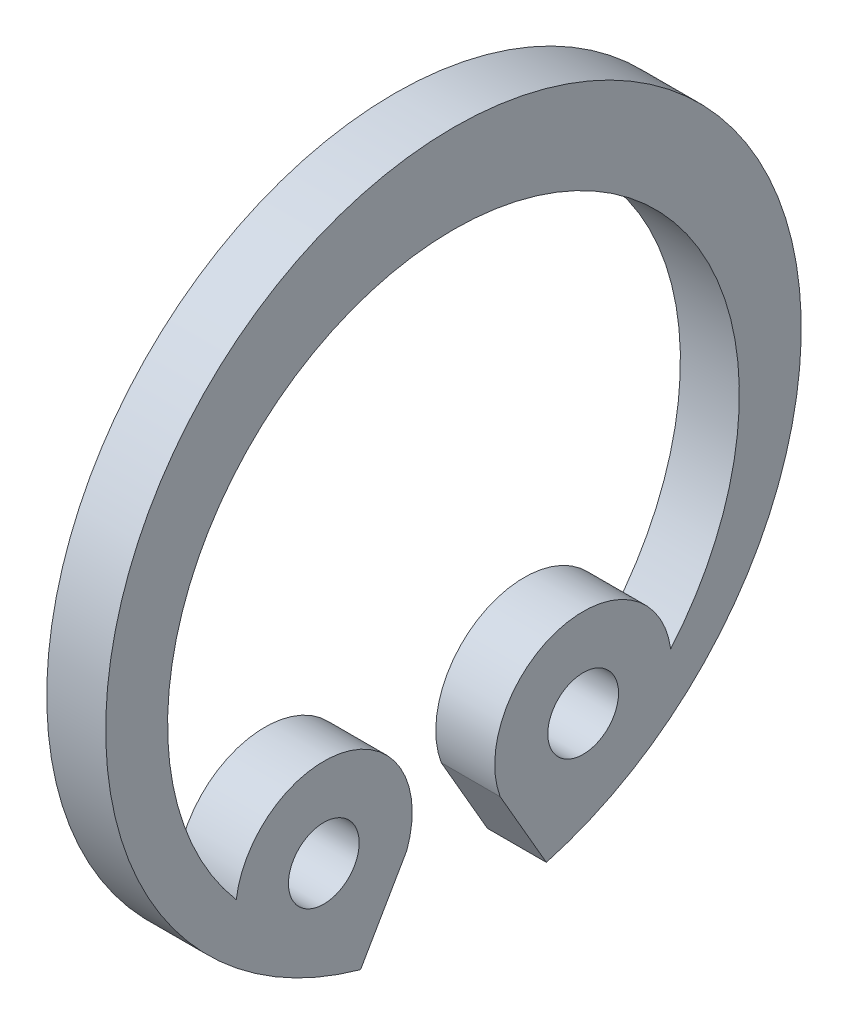
ISO-10303-21;
HEADER;
FILE_DESCRIPTION(('STEP AP214'),'2;1');
FILE_NAME('part.step','',(''),(''),'','','');
FILE_SCHEMA(('AUTOMOTIVE_DESIGN { 1 0 10303 214 1 1 1 1 }'));
ENDSEC;
DATA;
#1=APPLICATION_CONTEXT('core data for automotive mechanical design processes');
#2=APPLICATION_PROTOCOL_DEFINITION('international standard','automotive_design',2000,#1);
#3=PRODUCT_CONTEXT('',#1,'mechanical');
#4=PRODUCT('Part','Part','',(#3));
#5=PRODUCT_RELATED_PRODUCT_CATEGORY('part','',(#4));
#6=PRODUCT_DEFINITION_FORMATION('','',#4);
#7=PRODUCT_DEFINITION_CONTEXT('part definition',#1,'design');
#8=PRODUCT_DEFINITION('design','',#6,#7);
#9=PRODUCT_DEFINITION_SHAPE('','',#8);
#10=(LENGTH_UNIT() NAMED_UNIT(*) SI_UNIT(.MILLI.,.METRE.));
#11=(NAMED_UNIT(*) PLANE_ANGLE_UNIT() SI_UNIT($,.RADIAN.));
#12=(NAMED_UNIT(*) SI_UNIT($,.STERADIAN.) SOLID_ANGLE_UNIT());
#13=UNCERTAINTY_MEASURE_WITH_UNIT(LENGTH_MEASURE(1.E-05),#10,'distance_accuracy_value','');
#14=(GEOMETRIC_REPRESENTATION_CONTEXT(3) GLOBAL_UNCERTAINTY_ASSIGNED_CONTEXT((#13)) GLOBAL_UNIT_ASSIGNED_CONTEXT((#10,
#11,#12)) REPRESENTATION_CONTEXT('',''));
#15=CARTESIAN_POINT('',(0.,0.,0.));
#16=DIRECTION('',(0.,0.,1.));
#17=DIRECTION('',(1.,0.,0.));
#18=AXIS2_PLACEMENT_3D('',#15,#16,#17);
#19=CARTESIAN_POINT('',(0.5,0.,0.));
#20=DIRECTION('',(1.,0.,0.));
#21=DIRECTION('',(0.,0.,-1.));
#22=AXIS2_PLACEMENT_3D('',#19,#20,#21);
#23=PLANE('',#22);
#24=CARTESIAN_POINT('',(0.5,-3.81051177665153,-2.19999999999997));
#25=DIRECTION('',(1.,0.,0.));
#26=DIRECTION('',(0.,0.,-1.));
#27=AXIS2_PLACEMENT_3D('',#24,#25,#26);
#28=CIRCLE('',#27,0.600000000000028);
#29=CARTESIAN_POINT('',(0.5,-3.81051177665153,-2.8));
#30=VERTEX_POINT('',#29);
#31=EDGE_CURVE('E122',#30,#30,#28,.T.);
#32=ORIENTED_EDGE('',*,*,#31,.F.);
#33=EDGE_LOOP('',(#32));
#34=FACE_BOUND('',#33,.T.);
#35=CARTESIAN_POINT('',(0.5,0.,0.));
#36=DIRECTION('',(1.,0.,0.));
#37=DIRECTION('',(0.,0.,-1.));
#38=AXIS2_PLACEMENT_3D('',#35,#36,#37);
#39=CIRCLE('',#38,5.9);
#40=CARTESIAN_POINT('',(0.5,-5.685642181091,-1.5759038640091));
#41=VERTEX_POINT('',#40);
#42=CARTESIAN_POINT('',(0.5,-5.685642181091,1.5759038640091));
#43=VERTEX_POINT('',#42);
#44=EDGE_CURVE('E125',#41,#43,#39,.T.);
#45=ORIENTED_EDGE('',*,*,#44,.T.);
#46=DIRECTION('',(0.,0.866025403784457,-0.499999999999969));
#47=VECTOR('',#46,1.);
#48=CARTESIAN_POINT('',(0.5,-5.685642181091,1.5759038640091));
#49=LINE('',#48,#47);
#50=CARTESIAN_POINT('',(0.5,-4.328108982016,0.792131706089361));
#51=VERTEX_POINT('',#50);
#52=EDGE_CURVE('E87',#43,#51,#49,.T.);
#53=ORIENTED_EDGE('',*,*,#52,.T.);
#54=CARTESIAN_POINT('',(0.5,-3.81051177665152,2.19999999999998));
#55=DIRECTION('',(1.,0.,0.));
#56=DIRECTION('',(0.,0.,-1.));
#57=AXIS2_PLACEMENT_3D('',#54,#55,#56);
#58=CIRCLE('',#57,1.49999999999997);
#59=CARTESIAN_POINT('',(0.5,-3.6026747022655,3.6855314707237));
#60=VERTEX_POINT('',#59);
#61=EDGE_CURVE('E128',#51,#60,#58,.T.);
#62=ORIENTED_EDGE('',*,*,#61,.T.);
#63=CARTESIAN_POINT('',(0.5,-0.449999999999978,0.));
#64=DIRECTION('',(-1.,0.,0.));
#65=DIRECTION('',(0.,0.,1.));
#66=AXIS2_PLACEMENT_3D('',#63,#64,#65);
#67=CIRCLE('',#66,4.84999999999998);
#68=CARTESIAN_POINT('',(0.5,-3.6026747022655,-3.6855314707237));
#69=VERTEX_POINT('',#68);
#70=EDGE_CURVE('E130',#60,#69,#67,.T.);
#71=ORIENTED_EDGE('',*,*,#70,.T.);
#72=CARTESIAN_POINT('',(0.5,-3.81051177665153,-2.19999999999997));
#73=DIRECTION('',(1.,0.,0.));
#74=DIRECTION('',(0.,0.,-1.));
#75=AXIS2_PLACEMENT_3D('',#72,#73,#74);
#76=CIRCLE('',#75,1.49999999999998);
#77=CARTESIAN_POINT('',(0.5,-4.328108982016,-0.79213170608934));
#78=VERTEX_POINT('',#77);
#79=EDGE_CURVE('E51',#69,#78,#76,.T.);
#80=ORIENTED_EDGE('',*,*,#79,.T.);
#81=DIRECTION('',(0.,-0.866025403784451,-0.499999999999979));
#82=VECTOR('',#81,1.);
#83=CARTESIAN_POINT('',(0.5,-4.328108982016,-0.79213170608934));
#84=LINE('',#83,#82);
#85=EDGE_CURVE('E46',#78,#41,#84,.T.);
#86=ORIENTED_EDGE('',*,*,#85,.T.);
#87=EDGE_LOOP('',(#45,#53,#62,#71,#80,#86));
#88=FACE_BOUND('',#87,.T.);
#89=CARTESIAN_POINT('',(0.5,-3.81051177665152,2.19999999999998));
#90=DIRECTION('',(1.,0.,0.));
#91=DIRECTION('',(0.,0.,-1.));
#92=AXIS2_PLACEMENT_3D('',#89,#90,#91);
#93=CIRCLE('',#92,0.599999999999979);
#94=CARTESIAN_POINT('',(0.5,-3.81051177665152,1.6));
#95=VERTEX_POINT('',#94);
#96=EDGE_CURVE('E119',#95,#95,#93,.T.);
#97=ORIENTED_EDGE('',*,*,#96,.F.);
#98=EDGE_LOOP('',(#97));
#99=FACE_BOUND('',#98,.T.);
#100=ADVANCED_FACE('F31',(#34,#88,#99),#23,.T.);
#101=CARTESIAN_POINT('',(0.5,0.,0.));
#102=DIRECTION('',(-1.,0.,0.));
#103=DIRECTION('',(0.,0.,1.));
#104=AXIS2_PLACEMENT_3D('',#101,#102,#103);
#105=CYLINDRICAL_SURFACE('',#104,5.9);
#106=DIRECTION('',(-1.,0.,0.));
#107=VECTOR('',#106,1.);
#108=CARTESIAN_POINT('',(0.5,-5.685642181091,-1.5759038640091));
#109=LINE('',#108,#107);
#110=CARTESIAN_POINT('',(-0.5,-5.685642181091,-1.5759038640091));
#111=VERTEX_POINT('',#110);
#112=EDGE_CURVE('E102',#41,#111,#109,.T.);
#113=ORIENTED_EDGE('',*,*,#112,.T.);
#114=CARTESIAN_POINT('',(-0.5,0.,0.));
#115=DIRECTION('',(1.,0.,0.));
#116=DIRECTION('',(0.,0.,-1.));
#117=AXIS2_PLACEMENT_3D('',#114,#115,#116);
#118=CIRCLE('',#117,5.9);
#119=CARTESIAN_POINT('',(-0.5,-5.685642181091,1.5759038640091));
#120=VERTEX_POINT('',#119);
#121=EDGE_CURVE('E96',#111,#120,#118,.T.);
#122=ORIENTED_EDGE('',*,*,#121,.T.);
#123=DIRECTION('',(-1.,0.,0.));
#124=VECTOR('',#123,1.);
#125=CARTESIAN_POINT('',(0.5,-5.685642181091,1.5759038640091));
#126=LINE('',#125,#124);
#127=EDGE_CURVE('E11',#43,#120,#126,.T.);
#128=ORIENTED_EDGE('',*,*,#127,.F.);
#129=ORIENTED_EDGE('',*,*,#44,.F.);
#130=EDGE_LOOP('',(#113,#122,#128,#129));
#131=FACE_BOUND('',#130,.T.);
#132=ADVANCED_FACE('F33',(#131),#105,.T.);
#133=CARTESIAN_POINT('',(0.5,-5.685642181091,1.5759038640091));
#134=DIRECTION('',(0.,0.499999999999969,0.866025403784457));
#135=DIRECTION('',(0.,-0.866025403784456,0.499999999999969));
#136=AXIS2_PLACEMENT_3D('',#133,#134,#135);
#137=PLANE('',#136);
#138=ORIENTED_EDGE('',*,*,#127,.T.);
#139=DIRECTION('',(0.,0.866025403784457,-0.499999999999969));
#140=VECTOR('',#139,1.);
#141=CARTESIAN_POINT('',(-0.5,-5.685642181091,1.5759038640091));
#142=LINE('',#141,#140);
#143=CARTESIAN_POINT('',(-0.5,-4.328108982016,0.792131706089361));
#144=VERTEX_POINT('',#143);
#145=EDGE_CURVE('E86',#120,#144,#142,.T.);
#146=ORIENTED_EDGE('',*,*,#145,.T.);
#147=DIRECTION('',(-1.,0.,0.));
#148=VECTOR('',#147,1.);
#149=CARTESIAN_POINT('',(0.5,-4.328108982016,0.792131706089361));
#150=LINE('',#149,#148);
#151=EDGE_CURVE('E39',#51,#144,#150,.T.);
#152=ORIENTED_EDGE('',*,*,#151,.F.);
#153=ORIENTED_EDGE('',*,*,#52,.F.);
#154=EDGE_LOOP('',(#138,#146,#152,#153));
#155=FACE_BOUND('',#154,.T.);
#156=ADVANCED_FACE('F84',(#155),#137,.F.);
#157=CARTESIAN_POINT('',(0.5,-3.81051177665152,2.19999999999998));
#158=DIRECTION('',(-1.,0.,0.));
#159=DIRECTION('',(0.,0.,1.));
#160=AXIS2_PLACEMENT_3D('',#157,#158,#159);
#161=CYLINDRICAL_SURFACE('',#160,1.49999999999997);
#162=ORIENTED_EDGE('',*,*,#151,.T.);
#163=CARTESIAN_POINT('',(-0.5,-3.81051177665152,2.19999999999998));
#164=DIRECTION('',(1.,0.,0.));
#165=DIRECTION('',(0.,0.,-1.));
#166=AXIS2_PLACEMENT_3D('',#163,#164,#165);
#167=CIRCLE('',#166,1.49999999999997);
#168=CARTESIAN_POINT('',(-0.5,-3.6026747022655,3.6855314707237));
#169=VERTEX_POINT('',#168);
#170=EDGE_CURVE('E100',#144,#169,#167,.T.);
#171=ORIENTED_EDGE('',*,*,#170,.T.);
#172=DIRECTION('',(-1.,0.,0.));
#173=VECTOR('',#172,1.);
#174=CARTESIAN_POINT('',(0.5,-3.6026747022655,3.6855314707237));
#175=LINE('',#174,#173);
#176=EDGE_CURVE('E139',#60,#169,#175,.T.);
#177=ORIENTED_EDGE('',*,*,#176,.F.);
#178=ORIENTED_EDGE('',*,*,#61,.F.);
#179=EDGE_LOOP('',(#162,#171,#177,#178));
#180=FACE_BOUND('',#179,.T.);
#181=ADVANCED_FACE('F142',(#180),#161,.T.);
#182=CARTESIAN_POINT('',(0.5,-0.449999999999978,0.));
#183=DIRECTION('',(-1.,0.,0.));
#184=DIRECTION('',(0.,0.,1.));
#185=AXIS2_PLACEMENT_3D('',#182,#183,#184);
#186=CYLINDRICAL_SURFACE('',#185,4.84999999999998);
#187=ORIENTED_EDGE('',*,*,#176,.T.);
#188=CARTESIAN_POINT('',(-0.5,-0.449999999999978,0.));
#189=DIRECTION('',(-1.,0.,0.));
#190=DIRECTION('',(0.,0.,1.));
#191=AXIS2_PLACEMENT_3D('',#188,#189,#190);
#192=CIRCLE('',#191,4.84999999999998);
#193=CARTESIAN_POINT('',(-0.5,-3.6026747022655,-3.6855314707237));
#194=VERTEX_POINT('',#193);
#195=EDGE_CURVE('E111',#169,#194,#192,.T.);
#196=ORIENTED_EDGE('',*,*,#195,.T.);
#197=DIRECTION('',(-1.,0.,0.));
#198=VECTOR('',#197,1.);
#199=CARTESIAN_POINT('',(0.5,-3.6026747022655,-3.6855314707237));
#200=LINE('',#199,#198);
#201=EDGE_CURVE('E137',#69,#194,#200,.T.);
#202=ORIENTED_EDGE('',*,*,#201,.F.);
#203=ORIENTED_EDGE('',*,*,#70,.F.);
#204=EDGE_LOOP('',(#187,#196,#202,#203));
#205=FACE_BOUND('',#204,.T.);
#206=ADVANCED_FACE('F148',(#205),#186,.F.);
#207=CARTESIAN_POINT('',(0.5,-3.81051177665153,-2.19999999999997));
#208=DIRECTION('',(-1.,0.,0.));
#209=DIRECTION('',(0.,0.,1.));
#210=AXIS2_PLACEMENT_3D('',#207,#208,#209);
#211=CYLINDRICAL_SURFACE('',#210,1.49999999999998);
#212=ORIENTED_EDGE('',*,*,#201,.T.);
#213=CARTESIAN_POINT('',(-0.5,-3.81051177665153,-2.19999999999997));
#214=DIRECTION('',(1.,0.,0.));
#215=DIRECTION('',(0.,0.,-1.));
#216=AXIS2_PLACEMENT_3D('',#213,#214,#215);
#217=CIRCLE('',#216,1.49999999999998);
#218=CARTESIAN_POINT('',(-0.5,-4.328108982016,-0.79213170608934));
#219=VERTEX_POINT('',#218);
#220=EDGE_CURVE('E114',#194,#219,#217,.T.);
#221=ORIENTED_EDGE('',*,*,#220,.T.);
#222=DIRECTION('',(-1.,0.,0.));
#223=VECTOR('',#222,1.);
#224=CARTESIAN_POINT('',(0.5,-4.328108982016,-0.79213170608934));
#225=LINE('',#224,#223);
#226=EDGE_CURVE('E135',#78,#219,#225,.T.);
#227=ORIENTED_EDGE('',*,*,#226,.F.);
#228=ORIENTED_EDGE('',*,*,#79,.F.);
#229=EDGE_LOOP('',(#212,#221,#227,#228));
#230=FACE_BOUND('',#229,.T.);
#231=ADVANCED_FACE('F151',(#230),#211,.T.);
#232=CARTESIAN_POINT('',(0.5,-4.328108982016,-0.79213170608934));
#233=DIRECTION('',(0.,0.499999999999979,-0.866025403784451));
#234=DIRECTION('',(0.,0.866025403784451,0.499999999999979));
#235=AXIS2_PLACEMENT_3D('',#232,#233,#234);
#236=PLANE('',#235);
#237=ORIENTED_EDGE('',*,*,#226,.T.);
#238=DIRECTION('',(0.,-0.866025403784451,-0.499999999999979));
#239=VECTOR('',#238,1.);
#240=CARTESIAN_POINT('',(-0.5,-4.328108982016,-0.79213170608934));
#241=LINE('',#240,#239);
#242=EDGE_CURVE('E117',#219,#111,#241,.T.);
#243=ORIENTED_EDGE('',*,*,#242,.T.);
#244=ORIENTED_EDGE('',*,*,#112,.F.);
#245=ORIENTED_EDGE('',*,*,#85,.F.);
#246=EDGE_LOOP('',(#237,#243,#244,#245));
#247=FACE_BOUND('',#246,.T.);
#248=ADVANCED_FACE('F153',(#247),#236,.F.);
#249=CARTESIAN_POINT('',(0.5,-3.81051177665153,-2.19999999999997));
#250=DIRECTION('',(-1.,0.,0.));
#251=DIRECTION('',(0.,0.,1.));
#252=AXIS2_PLACEMENT_3D('',#249,#250,#251);
#253=CYLINDRICAL_SURFACE('',#252,0.600000000000028);
#254=ORIENTED_EDGE('',*,*,#31,.T.);
#255=EDGE_LOOP('',(#254));
#256=FACE_BOUND('',#255,.T.);
#257=CARTESIAN_POINT('',(-0.5,-3.81051177665153,-2.19999999999997));
#258=DIRECTION('',(1.,0.,0.));
#259=DIRECTION('',(0.,0.,-1.));
#260=AXIS2_PLACEMENT_3D('',#257,#258,#259);
#261=CIRCLE('',#260,0.600000000000028);
#262=CARTESIAN_POINT('',(-0.5,-3.81051177665153,-2.8));
#263=VERTEX_POINT('',#262);
#264=EDGE_CURVE('E103',#263,#263,#261,.T.);
#265=ORIENTED_EDGE('',*,*,#264,.F.);
#266=EDGE_LOOP('',(#265));
#267=FACE_BOUND('',#266,.T.);
#268=ADVANCED_FACE('F155',(#256,#267),#253,.F.);
#269=CARTESIAN_POINT('',(0.5,-3.81051177665152,2.19999999999998));
#270=DIRECTION('',(-1.,0.,0.));
#271=DIRECTION('',(0.,0.,1.));
#272=AXIS2_PLACEMENT_3D('',#269,#270,#271);
#273=CYLINDRICAL_SURFACE('',#272,0.599999999999979);
#274=ORIENTED_EDGE('',*,*,#96,.T.);
#275=EDGE_LOOP('',(#274));
#276=FACE_BOUND('',#275,.T.);
#277=CARTESIAN_POINT('',(-0.5,-3.81051177665152,2.19999999999998));
#278=DIRECTION('',(1.,0.,0.));
#279=DIRECTION('',(0.,0.,-1.));
#280=AXIS2_PLACEMENT_3D('',#277,#278,#279);
#281=CIRCLE('',#280,0.599999999999979);
#282=CARTESIAN_POINT('',(-0.5,-3.81051177665152,1.6));
#283=VERTEX_POINT('',#282);
#284=EDGE_CURVE('E106',#283,#283,#281,.T.);
#285=ORIENTED_EDGE('',*,*,#284,.F.);
#286=EDGE_LOOP('',(#285));
#287=FACE_BOUND('',#286,.T.);
#288=ADVANCED_FACE('F161',(#276,#287),#273,.F.);
#289=CARTESIAN_POINT('',(-0.5,0.,0.));
#290=DIRECTION('',(1.,0.,0.));
#291=DIRECTION('',(0.,0.,-1.));
#292=AXIS2_PLACEMENT_3D('',#289,#290,#291);
#293=PLANE('',#292);
#294=ORIENTED_EDGE('',*,*,#284,.T.);
#295=EDGE_LOOP('',(#294));
#296=FACE_BOUND('',#295,.T.);
#297=ORIENTED_EDGE('',*,*,#264,.T.);
#298=EDGE_LOOP('',(#297));
#299=FACE_BOUND('',#298,.T.);
#300=ORIENTED_EDGE('',*,*,#121,.F.);
#301=ORIENTED_EDGE('',*,*,#242,.F.);
#302=ORIENTED_EDGE('',*,*,#220,.F.);
#303=ORIENTED_EDGE('',*,*,#195,.F.);
#304=ORIENTED_EDGE('',*,*,#170,.F.);
#305=ORIENTED_EDGE('',*,*,#145,.F.);
#306=EDGE_LOOP('',(#300,#301,#302,#303,#304,#305));
#307=FACE_BOUND('',#306,.T.);
#308=ADVANCED_FACE('F94',(#296,#299,#307),#293,.F.);
#309=CLOSED_SHELL('',(#100,#132,#156,#181,#206,#231,#248,#268,#288,#308));
#310=MANIFOLD_SOLID_BREP('B2',#309);
#311=ADVANCED_BREP_SHAPE_REPRESENTATION('',(#18,#310),#14);
#312=SHAPE_DEFINITION_REPRESENTATION(#9,#311);
ENDSEC;
END-ISO-10303-21;
